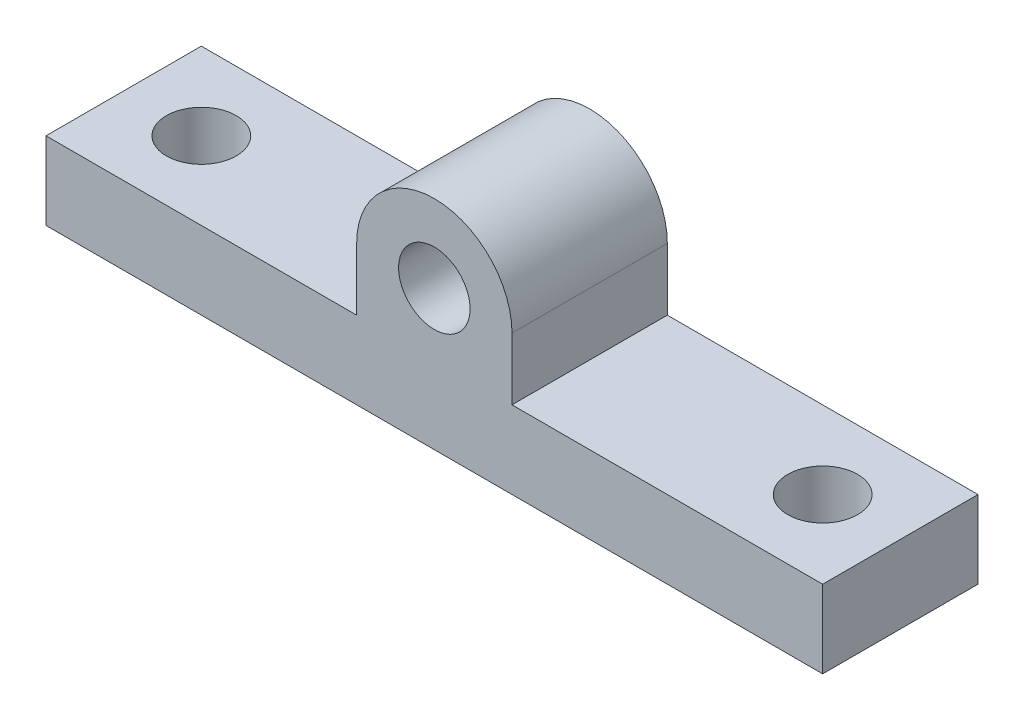
ISO-10303-21;
HEADER;
FILE_DESCRIPTION(('STEP AP214'),'2;1');
FILE_NAME('part.step','',(''),(''),'','','');
FILE_SCHEMA(('AUTOMOTIVE_DESIGN { 1 0 10303 214 1 1 1 1 }'));
ENDSEC;
DATA;
#1=APPLICATION_CONTEXT('core data for automotive mechanical design processes');
#2=APPLICATION_PROTOCOL_DEFINITION('international standard','automotive_design',2000,#1);
#3=PRODUCT_CONTEXT('',#1,'mechanical');
#4=PRODUCT('Part','Part','',(#3));
#5=PRODUCT_RELATED_PRODUCT_CATEGORY('part','',(#4));
#6=PRODUCT_DEFINITION_FORMATION('','',#4);
#7=PRODUCT_DEFINITION_CONTEXT('part definition',#1,'design');
#8=PRODUCT_DEFINITION('design','',#6,#7);
#9=PRODUCT_DEFINITION_SHAPE('','',#8);
#10=(LENGTH_UNIT() NAMED_UNIT(*) SI_UNIT(.MILLI.,.METRE.));
#11=(NAMED_UNIT(*) PLANE_ANGLE_UNIT() SI_UNIT($,.RADIAN.));
#12=(NAMED_UNIT(*) SI_UNIT($,.STERADIAN.) SOLID_ANGLE_UNIT());
#13=UNCERTAINTY_MEASURE_WITH_UNIT(LENGTH_MEASURE(1.E-05),#10,'distance_accuracy_value','');
#14=(GEOMETRIC_REPRESENTATION_CONTEXT(3) GLOBAL_UNCERTAINTY_ASSIGNED_CONTEXT((#13)) GLOBAL_UNIT_ASSIGNED_CONTEXT((#10,
#11,#12)) REPRESENTATION_CONTEXT('',''));
#15=CARTESIAN_POINT('',(0.,0.,0.));
#16=DIRECTION('',(0.,0.,1.));
#17=DIRECTION('',(1.,0.,0.));
#18=AXIS2_PLACEMENT_3D('',#15,#16,#17);
#19=CARTESIAN_POINT('',(0.,5.,0.));
#20=DIRECTION('',(0.,-1.,0.));
#21=DIRECTION('',(0.,0.,-1.));
#22=AXIS2_PLACEMENT_3D('',#19,#20,#21);
#23=PLANE('',#22);
#24=CARTESIAN_POINT('',(-20.,5.,0.));
#25=DIRECTION('',(0.,1.,0.));
#26=DIRECTION('',(0.,0.,1.));
#27=AXIS2_PLACEMENT_3D('',#24,#25,#26);
#28=CIRCLE('',#27,2.25);
#29=CARTESIAN_POINT('',(-20.,5.,2.25));
#30=VERTEX_POINT('',#29);
#31=EDGE_CURVE('E147',#30,#30,#28,.T.);
#32=ORIENTED_EDGE('',*,*,#31,.F.);
#33=EDGE_LOOP('',(#32));
#34=FACE_BOUND('',#33,.T.);
#35=DIRECTION('',(0.,0.,1.));
#36=VECTOR('',#35,1.);
#37=CARTESIAN_POINT('',(-5.,5.,-18.4536240470737));
#38=LINE('',#37,#36);
#39=CARTESIAN_POINT('',(-5.,5.,-5.));
#40=VERTEX_POINT('',#39);
#41=CARTESIAN_POINT('',(-5.,5.,5.));
#42=VERTEX_POINT('',#41);
#43=EDGE_CURVE('E49',#40,#42,#38,.T.);
#44=ORIENTED_EDGE('',*,*,#43,.F.);
#45=DIRECTION('',(-1.,0.,0.));
#46=VECTOR('',#45,1.);
#47=CARTESIAN_POINT('',(-25.,5.,-5.));
#48=LINE('',#47,#46);
#49=CARTESIAN_POINT('',(-25.,5.,-5.));
#50=VERTEX_POINT('',#49);
#51=EDGE_CURVE('E184',#40,#50,#48,.T.);
#52=ORIENTED_EDGE('',*,*,#51,.T.);
#53=DIRECTION('',(0.,0.,1.));
#54=VECTOR('',#53,1.);
#55=CARTESIAN_POINT('',(-25.,5.,5.));
#56=LINE('',#55,#54);
#57=CARTESIAN_POINT('',(-25.,5.,5.));
#58=VERTEX_POINT('',#57);
#59=EDGE_CURVE('E153',#50,#58,#56,.T.);
#60=ORIENTED_EDGE('',*,*,#59,.T.);
#61=DIRECTION('',(1.,0.,0.));
#62=VECTOR('',#61,1.);
#63=CARTESIAN_POINT('',(-25.,5.,5.));
#64=LINE('',#63,#62);
#65=EDGE_CURVE('E165',#58,#42,#64,.T.);
#66=ORIENTED_EDGE('',*,*,#65,.T.);
#67=EDGE_LOOP('',(#44,#52,#60,#66));
#68=FACE_BOUND('',#67,.T.);
#69=ADVANCED_FACE('F32',(#34,#68),#23,.F.);
#70=CARTESIAN_POINT('',(25.,5.,-5.));
#71=VERTEX_POINT('',#70);
#72=CARTESIAN_POINT('',(5.,5.,-5.));
#73=VERTEX_POINT('',#72);
#74=EDGE_CURVE('E57',#71,#73,#48,.T.);
#75=ORIENTED_EDGE('',*,*,#74,.T.);
#76=DIRECTION('',(0.,0.,1.));
#77=VECTOR('',#76,1.);
#78=CARTESIAN_POINT('',(5.,5.,-18.4536240470737));
#79=LINE('',#78,#77);
#80=CARTESIAN_POINT('',(5.,5.,5.));
#81=VERTEX_POINT('',#80);
#82=EDGE_CURVE('E110',#73,#81,#79,.T.);
#83=ORIENTED_EDGE('',*,*,#82,.T.);
#84=CARTESIAN_POINT('',(25.,5.,5.));
#85=VERTEX_POINT('',#84);
#86=EDGE_CURVE('E125',#81,#85,#64,.T.);
#87=ORIENTED_EDGE('',*,*,#86,.T.);
#88=DIRECTION('',(0.,0.,-1.));
#89=VECTOR('',#88,1.);
#90=CARTESIAN_POINT('',(25.,5.,5.));
#91=LINE('',#90,#89);
#92=EDGE_CURVE('E159',#85,#71,#91,.T.);
#93=ORIENTED_EDGE('',*,*,#92,.T.);
#94=EDGE_LOOP('',(#75,#83,#87,#93));
#95=FACE_BOUND('',#94,.T.);
#96=CARTESIAN_POINT('',(20.,5.,0.));
#97=DIRECTION('',(0.,1.,0.));
#98=DIRECTION('',(0.,0.,1.));
#99=AXIS2_PLACEMENT_3D('',#96,#97,#98);
#100=CIRCLE('',#99,2.25);
#101=CARTESIAN_POINT('',(20.,5.,2.25));
#102=VERTEX_POINT('',#101);
#103=EDGE_CURVE('E141',#102,#102,#100,.T.);
#104=ORIENTED_EDGE('',*,*,#103,.F.);
#105=EDGE_LOOP('',(#104));
#106=FACE_BOUND('',#105,.T.);
#107=ADVANCED_FACE('F189',(#95,#106),#23,.F.);
#108=CARTESIAN_POINT('',(0.,0.,0.));
#109=DIRECTION('',(0.,-1.,0.));
#110=DIRECTION('',(0.,0.,-1.));
#111=AXIS2_PLACEMENT_3D('',#108,#109,#110);
#112=PLANE('',#111);
#113=CARTESIAN_POINT('',(-20.,0.,0.));
#114=DIRECTION('',(0.,1.,0.));
#115=DIRECTION('',(0.,0.,1.));
#116=AXIS2_PLACEMENT_3D('',#113,#114,#115);
#117=CIRCLE('',#116,2.25);
#118=CARTESIAN_POINT('',(-20.,0.,2.25));
#119=VERTEX_POINT('',#118);
#120=EDGE_CURVE('E144',#119,#119,#117,.T.);
#121=ORIENTED_EDGE('',*,*,#120,.T.);
#122=EDGE_LOOP('',(#121));
#123=FACE_BOUND('',#122,.T.);
#124=DIRECTION('',(0.,0.,1.));
#125=VECTOR('',#124,1.);
#126=CARTESIAN_POINT('',(-25.,0.,5.));
#127=LINE('',#126,#125);
#128=CARTESIAN_POINT('',(-25.,0.,-5.));
#129=VERTEX_POINT('',#128);
#130=CARTESIAN_POINT('',(-25.,0.,5.));
#131=VERTEX_POINT('',#130);
#132=EDGE_CURVE('E150',#129,#131,#127,.T.);
#133=ORIENTED_EDGE('',*,*,#132,.F.);
#134=DIRECTION('',(-1.,0.,0.));
#135=VECTOR('',#134,1.);
#136=CARTESIAN_POINT('',(-25.,0.,-5.));
#137=LINE('',#136,#135);
#138=CARTESIAN_POINT('',(25.,0.,-5.));
#139=VERTEX_POINT('',#138);
#140=EDGE_CURVE('E156',#139,#129,#137,.T.);
#141=ORIENTED_EDGE('',*,*,#140,.F.);
#142=DIRECTION('',(0.,0.,-1.));
#143=VECTOR('',#142,1.);
#144=CARTESIAN_POINT('',(25.,0.,5.));
#145=LINE('',#144,#143);
#146=CARTESIAN_POINT('',(25.,0.,5.));
#147=VERTEX_POINT('',#146);
#148=EDGE_CURVE('E176',#147,#139,#145,.T.);
#149=ORIENTED_EDGE('',*,*,#148,.F.);
#150=DIRECTION('',(1.,0.,0.));
#151=VECTOR('',#150,1.);
#152=CARTESIAN_POINT('',(-25.,0.,5.));
#153=LINE('',#152,#151);
#154=EDGE_CURVE('E178',#131,#147,#153,.T.);
#155=ORIENTED_EDGE('',*,*,#154,.F.);
#156=EDGE_LOOP('',(#133,#141,#149,#155));
#157=FACE_BOUND('',#156,.T.);
#158=CARTESIAN_POINT('',(20.,0.,0.));
#159=DIRECTION('',(0.,1.,0.));
#160=DIRECTION('',(0.,0.,1.));
#161=AXIS2_PLACEMENT_3D('',#158,#159,#160);
#162=CIRCLE('',#161,2.25);
#163=CARTESIAN_POINT('',(20.,0.,2.25));
#164=VERTEX_POINT('',#163);
#165=EDGE_CURVE('E140',#164,#164,#162,.T.);
#166=ORIENTED_EDGE('',*,*,#165,.T.);
#167=EDGE_LOOP('',(#166));
#168=FACE_BOUND('',#167,.T.);
#169=ADVANCED_FACE('F217',(#123,#157,#168),#112,.T.);
#170=CARTESIAN_POINT('',(-25.,5.,5.));
#171=DIRECTION('',(1.,0.,0.));
#172=DIRECTION('',(0.,0.,-1.));
#173=AXIS2_PLACEMENT_3D('',#170,#171,#172);
#174=PLANE('',#173);
#175=ORIENTED_EDGE('',*,*,#132,.T.);
#176=DIRECTION('',(0.,-1.,0.));
#177=VECTOR('',#176,1.);
#178=CARTESIAN_POINT('',(-25.,5.,5.));
#179=LINE('',#178,#177);
#180=EDGE_CURVE('E11',#58,#131,#179,.T.);
#181=ORIENTED_EDGE('',*,*,#180,.F.);
#182=ORIENTED_EDGE('',*,*,#59,.F.);
#183=DIRECTION('',(0.,-1.,0.));
#184=VECTOR('',#183,1.);
#185=CARTESIAN_POINT('',(-25.,5.,-5.));
#186=LINE('',#185,#184);
#187=EDGE_CURVE('E172',#50,#129,#186,.T.);
#188=ORIENTED_EDGE('',*,*,#187,.T.);
#189=EDGE_LOOP('',(#175,#181,#182,#188));
#190=FACE_BOUND('',#189,.T.);
#191=ADVANCED_FACE('F34',(#190),#174,.F.);
#192=CARTESIAN_POINT('',(-25.,5.,5.));
#193=DIRECTION('',(0.,0.,-1.));
#194=DIRECTION('',(-1.,0.,0.));
#195=AXIS2_PLACEMENT_3D('',#192,#193,#194);
#196=PLANE('',#195);
#197=ORIENTED_EDGE('',*,*,#154,.T.);
#198=DIRECTION('',(0.,-1.,0.));
#199=VECTOR('',#198,1.);
#200=CARTESIAN_POINT('',(25.,5.,5.));
#201=LINE('',#200,#199);
#202=EDGE_CURVE('E41',#85,#147,#201,.T.);
#203=ORIENTED_EDGE('',*,*,#202,.F.);
#204=ORIENTED_EDGE('',*,*,#86,.F.);
#205=DIRECTION('',(0.,1.,0.));
#206=VECTOR('',#205,1.);
#207=CARTESIAN_POINT('',(5.,9.,5.));
#208=LINE('',#207,#206);
#209=CARTESIAN_POINT('',(5.,9.,5.));
#210=VERTEX_POINT('',#209);
#211=EDGE_CURVE('E105',#81,#210,#208,.T.);
#212=ORIENTED_EDGE('',*,*,#211,.T.);
#213=CARTESIAN_POINT('',(0.,9.,5.));
#214=DIRECTION('',(0.,0.,1.));
#215=DIRECTION('',(-1.,0.,0.));
#216=AXIS2_PLACEMENT_3D('',#213,#214,#215);
#217=CIRCLE('',#216,5.);
#218=CARTESIAN_POINT('',(-5.,9.,5.));
#219=VERTEX_POINT('',#218);
#220=EDGE_CURVE('E113',#210,#219,#217,.T.);
#221=ORIENTED_EDGE('',*,*,#220,.T.);
#222=DIRECTION('',(0.,-1.,0.));
#223=VECTOR('',#222,1.);
#224=CARTESIAN_POINT('',(-5.,5.,5.));
#225=LINE('',#224,#223);
#226=EDGE_CURVE('E119',#219,#42,#225,.T.);
#227=ORIENTED_EDGE('',*,*,#226,.T.);
#228=ORIENTED_EDGE('',*,*,#65,.F.);
#229=ORIENTED_EDGE('',*,*,#180,.T.);
#230=EDGE_LOOP('',(#197,#203,#204,#212,#221,#227,#228,#229));
#231=FACE_BOUND('',#230,.T.);
#232=CARTESIAN_POINT('',(0.,9.,5.));
#233=DIRECTION('',(0.,0.,1.));
#234=DIRECTION('',(1.,0.,0.));
#235=AXIS2_PLACEMENT_3D('',#232,#233,#234);
#236=CIRCLE('',#235,2.3);
#237=CARTESIAN_POINT('',(2.3,9.,5.));
#238=VERTEX_POINT('',#237);
#239=EDGE_CURVE('E126',#238,#238,#236,.T.);
#240=ORIENTED_EDGE('',*,*,#239,.F.);
#241=EDGE_LOOP('',(#240));
#242=FACE_BOUND('',#241,.T.);
#243=ADVANCED_FACE('F122',(#231,#242),#196,.F.);
#244=CARTESIAN_POINT('',(25.,5.,5.));
#245=DIRECTION('',(-1.,0.,0.));
#246=DIRECTION('',(0.,0.,1.));
#247=AXIS2_PLACEMENT_3D('',#244,#245,#246);
#248=PLANE('',#247);
#249=ORIENTED_EDGE('',*,*,#148,.T.);
#250=DIRECTION('',(0.,-1.,0.));
#251=VECTOR('',#250,1.);
#252=CARTESIAN_POINT('',(25.,5.,-5.));
#253=LINE('',#252,#251);
#254=EDGE_CURVE('E169',#71,#139,#253,.T.);
#255=ORIENTED_EDGE('',*,*,#254,.F.);
#256=ORIENTED_EDGE('',*,*,#92,.F.);
#257=ORIENTED_EDGE('',*,*,#202,.T.);
#258=EDGE_LOOP('',(#249,#255,#256,#257));
#259=FACE_BOUND('',#258,.T.);
#260=ADVANCED_FACE('F192',(#259),#248,.F.);
#261=CARTESIAN_POINT('',(-25.,5.,-5.));
#262=DIRECTION('',(0.,0.,1.));
#263=DIRECTION('',(1.,0.,0.));
#264=AXIS2_PLACEMENT_3D('',#261,#262,#263);
#265=PLANE('',#264);
#266=ORIENTED_EDGE('',*,*,#140,.T.);
#267=ORIENTED_EDGE('',*,*,#187,.F.);
#268=ORIENTED_EDGE('',*,*,#51,.F.);
#269=DIRECTION('',(0.,1.,0.));
#270=VECTOR('',#269,1.);
#271=CARTESIAN_POINT('',(-5.,5.,-5.));
#272=LINE('',#271,#270);
#273=CARTESIAN_POINT('',(-5.,9.,-5.));
#274=VERTEX_POINT('',#273);
#275=EDGE_CURVE('E199',#40,#274,#272,.T.);
#276=ORIENTED_EDGE('',*,*,#275,.T.);
#277=CARTESIAN_POINT('',(0.,9.,-5.));
#278=DIRECTION('',(0.,0.,1.));
#279=DIRECTION('',(1.,0.,0.));
#280=AXIS2_PLACEMENT_3D('',#277,#278,#279);
#281=CIRCLE('',#280,5.);
#282=CARTESIAN_POINT('',(5.,9.,-5.));
#283=VERTEX_POINT('',#282);
#284=EDGE_CURVE('E198',#274,#283,#281,.F.);
#285=ORIENTED_EDGE('',*,*,#284,.T.);
#286=DIRECTION('',(0.,-1.,0.));
#287=VECTOR('',#286,1.);
#288=CARTESIAN_POINT('',(5.,9.,-5.));
#289=LINE('',#288,#287);
#290=EDGE_CURVE('E106',#283,#73,#289,.T.);
#291=ORIENTED_EDGE('',*,*,#290,.T.);
#292=ORIENTED_EDGE('',*,*,#74,.F.);
#293=ORIENTED_EDGE('',*,*,#254,.T.);
#294=EDGE_LOOP('',(#266,#267,#268,#276,#285,#291,#292,#293));
#295=FACE_BOUND('',#294,.T.);
#296=CARTESIAN_POINT('',(0.,9.,-5.));
#297=DIRECTION('',(0.,0.,1.));
#298=DIRECTION('',(1.,0.,0.));
#299=AXIS2_PLACEMENT_3D('',#296,#297,#298);
#300=CIRCLE('',#299,2.3);
#301=CARTESIAN_POINT('',(2.3,9.,-5.));
#302=VERTEX_POINT('',#301);
#303=EDGE_CURVE('E137',#302,#302,#300,.F.);
#304=ORIENTED_EDGE('',*,*,#303,.F.);
#305=EDGE_LOOP('',(#304));
#306=FACE_BOUND('',#305,.T.);
#307=ADVANCED_FACE('F196',(#295,#306),#265,.F.);
#308=CARTESIAN_POINT('',(-20.,5.,0.));
#309=DIRECTION('',(0.,-1.,0.));
#310=DIRECTION('',(0.,0.,-1.));
#311=AXIS2_PLACEMENT_3D('',#308,#309,#310);
#312=CYLINDRICAL_SURFACE('',#311,2.25);
#313=ORIENTED_EDGE('',*,*,#31,.T.);
#314=EDGE_LOOP('',(#313));
#315=FACE_BOUND('',#314,.T.);
#316=ORIENTED_EDGE('',*,*,#120,.F.);
#317=EDGE_LOOP('',(#316));
#318=FACE_BOUND('',#317,.T.);
#319=ADVANCED_FACE('F226',(#315,#318),#312,.F.);
#320=CARTESIAN_POINT('',(20.,5.,0.));
#321=DIRECTION('',(0.,-1.,0.));
#322=DIRECTION('',(0.,0.,-1.));
#323=AXIS2_PLACEMENT_3D('',#320,#321,#322);
#324=CYLINDRICAL_SURFACE('',#323,2.25);
#325=ORIENTED_EDGE('',*,*,#103,.T.);
#326=EDGE_LOOP('',(#325));
#327=FACE_BOUND('',#326,.T.);
#328=ORIENTED_EDGE('',*,*,#165,.F.);
#329=EDGE_LOOP('',(#328));
#330=FACE_BOUND('',#329,.T.);
#331=ADVANCED_FACE('F224',(#327,#330),#324,.F.);
#332=CARTESIAN_POINT('',(5.,9.,-18.4536240470737));
#333=DIRECTION('',(1.,0.,0.));
#334=DIRECTION('',(0.,1.,0.));
#335=AXIS2_PLACEMENT_3D('',#332,#333,#334);
#336=PLANE('',#335);
#337=ORIENTED_EDGE('',*,*,#290,.F.);
#338=DIRECTION('',(0.,0.,1.));
#339=VECTOR('',#338,1.);
#340=CARTESIAN_POINT('',(5.,9.,-18.4536240470737));
#341=LINE('',#340,#339);
#342=EDGE_CURVE('E100',#283,#210,#341,.T.);
#343=ORIENTED_EDGE('',*,*,#342,.T.);
#344=ORIENTED_EDGE('',*,*,#211,.F.);
#345=ORIENTED_EDGE('',*,*,#82,.F.);
#346=EDGE_LOOP('',(#337,#343,#344,#345));
#347=FACE_BOUND('',#346,.T.);
#348=ADVANCED_FACE('F102',(#347),#336,.T.);
#349=CARTESIAN_POINT('',(0.,9.,-18.4536240470737));
#350=DIRECTION('',(0.,0.,1.));
#351=DIRECTION('',(1.,0.,0.));
#352=AXIS2_PLACEMENT_3D('',#349,#350,#351);
#353=CYLINDRICAL_SURFACE('',#352,5.);
#354=ORIENTED_EDGE('',*,*,#284,.F.);
#355=DIRECTION('',(0.,0.,1.));
#356=VECTOR('',#355,1.);
#357=CARTESIAN_POINT('',(-5.,9.,-18.4536240470737));
#358=LINE('',#357,#356);
#359=EDGE_CURVE('E109',#274,#219,#358,.T.);
#360=ORIENTED_EDGE('',*,*,#359,.T.);
#361=ORIENTED_EDGE('',*,*,#220,.F.);
#362=ORIENTED_EDGE('',*,*,#342,.F.);
#363=EDGE_LOOP('',(#354,#360,#361,#362));
#364=FACE_BOUND('',#363,.T.);
#365=ADVANCED_FACE('F114',(#364),#353,.T.);
#366=CARTESIAN_POINT('',(-5.,5.,-18.4536240470737));
#367=DIRECTION('',(-1.,0.,0.));
#368=DIRECTION('',(0.,-1.,0.));
#369=AXIS2_PLACEMENT_3D('',#366,#367,#368);
#370=PLANE('',#369);
#371=ORIENTED_EDGE('',*,*,#275,.F.);
#372=ORIENTED_EDGE('',*,*,#43,.T.);
#373=ORIENTED_EDGE('',*,*,#226,.F.);
#374=ORIENTED_EDGE('',*,*,#359,.F.);
#375=EDGE_LOOP('',(#371,#372,#373,#374));
#376=FACE_BOUND('',#375,.T.);
#377=ADVANCED_FACE('F211',(#376),#370,.T.);
#378=CARTESIAN_POINT('',(0.,9.,-18.4536240470737));
#379=DIRECTION('',(0.,0.,1.));
#380=DIRECTION('',(1.,0.,0.));
#381=AXIS2_PLACEMENT_3D('',#378,#379,#380);
#382=CYLINDRICAL_SURFACE('',#381,2.3);
#383=ORIENTED_EDGE('',*,*,#303,.T.);
#384=EDGE_LOOP('',(#383));
#385=FACE_BOUND('',#384,.T.);
#386=ORIENTED_EDGE('',*,*,#239,.T.);
#387=EDGE_LOOP('',(#386));
#388=FACE_BOUND('',#387,.T.);
#389=ADVANCED_FACE('F299',(#385,#388),#382,.F.);
#390=CLOSED_SHELL('',(#69,#107,#169,#191,#243,#260,#307,#319,#331,#348,#365,#377,#389));
#391=MANIFOLD_SOLID_BREP('B2',#390);
#392=ADVANCED_BREP_SHAPE_REPRESENTATION('',(#18,#391),#14);
#393=SHAPE_DEFINITION_REPRESENTATION(#9,#392);
ENDSEC;
END-ISO-10303-21;
